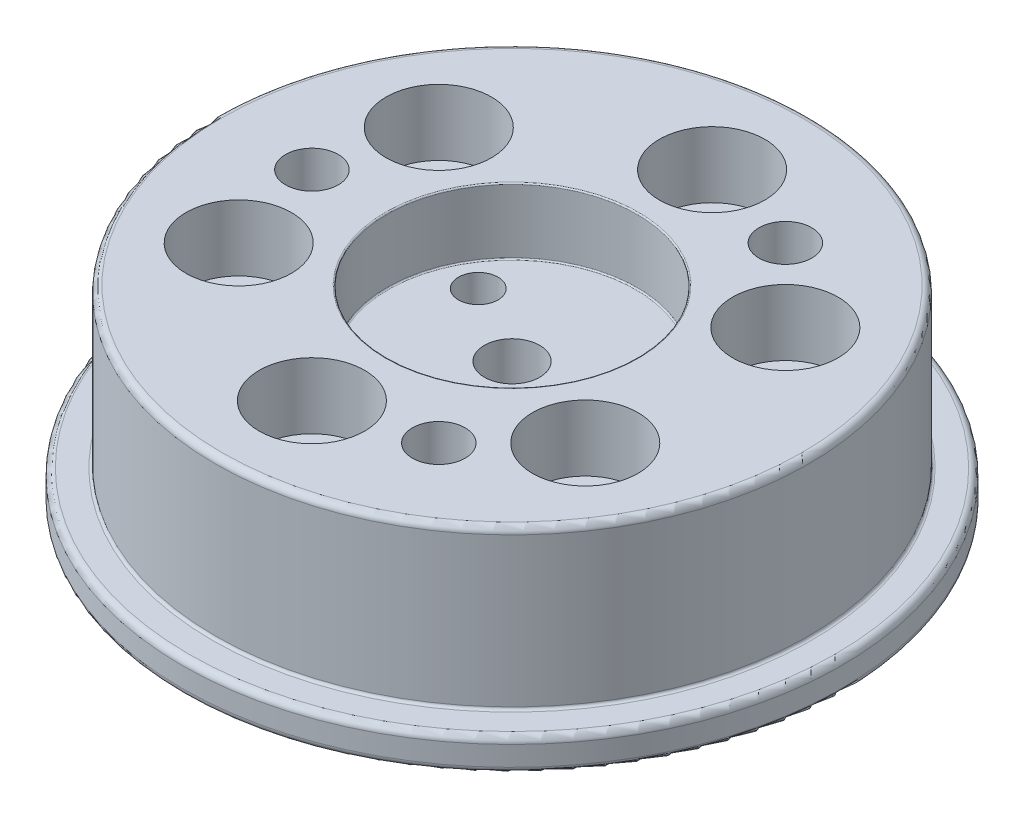
ISO-10303-21;
HEADER;
FILE_DESCRIPTION(('STEP AP214'),'2;1');
FILE_NAME('part.step','',(''),(''),'','','');
FILE_SCHEMA(('AUTOMOTIVE_DESIGN { 1 0 10303 214 1 1 1 1 }'));
ENDSEC;
DATA;
#1=APPLICATION_CONTEXT('core data for automotive mechanical design processes');
#2=APPLICATION_PROTOCOL_DEFINITION('international standard','automotive_design',2000,#1);
#3=PRODUCT_CONTEXT('',#1,'mechanical');
#4=PRODUCT('Part','Part','',(#3));
#5=PRODUCT_RELATED_PRODUCT_CATEGORY('part','',(#4));
#6=PRODUCT_DEFINITION_FORMATION('','',#4);
#7=PRODUCT_DEFINITION_CONTEXT('part definition',#1,'design');
#8=PRODUCT_DEFINITION('design','',#6,#7);
#9=PRODUCT_DEFINITION_SHAPE('','',#8);
#10=(LENGTH_UNIT() NAMED_UNIT(*) SI_UNIT(.MILLI.,.METRE.));
#11=(NAMED_UNIT(*) PLANE_ANGLE_UNIT() SI_UNIT($,.RADIAN.));
#12=(NAMED_UNIT(*) SI_UNIT($,.STERADIAN.) SOLID_ANGLE_UNIT());
#13=UNCERTAINTY_MEASURE_WITH_UNIT(LENGTH_MEASURE(1.E-05),#10,'distance_accuracy_value','');
#14=(GEOMETRIC_REPRESENTATION_CONTEXT(3) GLOBAL_UNCERTAINTY_ASSIGNED_CONTEXT((#13)) GLOBAL_UNIT_ASSIGNED_CONTEXT((#10,
#11,#12)) REPRESENTATION_CONTEXT('',''));
#15=CARTESIAN_POINT('',(0.,0.,0.));
#16=DIRECTION('',(0.,0.,1.));
#17=DIRECTION('',(1.,0.,0.));
#18=AXIS2_PLACEMENT_3D('',#15,#16,#17);
#19=CARTESIAN_POINT('',(0.,2.5,0.));
#20=DIRECTION('',(0.,-1.,0.));
#21=DIRECTION('',(0.,0.,-1.));
#22=AXIS2_PLACEMENT_3D('',#19,#20,#21);
#23=CYLINDRICAL_SURFACE('',#22,10.1);
#24=CARTESIAN_POINT('',(0.,0.5,0.));
#25=DIRECTION('',(0.,1.,0.));
#26=DIRECTION('',(0.,0.,1.));
#27=AXIS2_PLACEMENT_3D('',#24,#25,#26);
#28=CIRCLE('',#27,10.1);
#29=CARTESIAN_POINT('',(0.,0.5,10.1));
#30=VERTEX_POINT('',#29);
#31=EDGE_CURVE('E164',#30,#30,#28,.T.);
#32=ORIENTED_EDGE('',*,*,#31,.T.);
#33=EDGE_LOOP('',(#32));
#34=FACE_BOUND('',#33,.T.);
#35=CARTESIAN_POINT('',(0.,2.5,0.));
#36=DIRECTION('',(0.,1.,0.));
#37=DIRECTION('',(0.,0.,1.));
#38=AXIS2_PLACEMENT_3D('',#35,#36,#37);
#39=CIRCLE('',#38,10.1);
#40=CARTESIAN_POINT('',(0.,2.5,10.1));
#41=VERTEX_POINT('',#40);
#42=EDGE_CURVE('E161',#41,#41,#39,.T.);
#43=ORIENTED_EDGE('',*,*,#42,.F.);
#44=EDGE_LOOP('',(#43));
#45=FACE_BOUND('',#44,.T.);
#46=ADVANCED_FACE('F36',(#34,#45),#23,.T.);
#47=CARTESIAN_POINT('',(0.,0.,0.));
#48=DIRECTION('',(0.,1.,0.));
#49=DIRECTION('',(0.,0.,1.));
#50=AXIS2_PLACEMENT_3D('',#47,#48,#49);
#51=PLANE('',#50);
#52=CARTESIAN_POINT('',(0.,0.,0.));
#53=DIRECTION('',(0.,1.,0.));
#54=DIRECTION('',(0.,0.,1.));
#55=AXIS2_PLACEMENT_3D('',#52,#53,#54);
#56=CIRCLE('',#55,2.1);
#57=CARTESIAN_POINT('',(0.,0.,2.1));
#58=VERTEX_POINT('',#57);
#59=EDGE_CURVE('E71',#58,#58,#56,.T.);
#60=ORIENTED_EDGE('',*,*,#59,.T.);
#61=EDGE_LOOP('',(#60));
#62=FACE_BOUND('',#61,.T.);
#63=CARTESIAN_POINT('',(0.,0.,0.));
#64=DIRECTION('',(0.,1.,0.));
#65=DIRECTION('',(0.,0.,1.));
#66=AXIS2_PLACEMENT_3D('',#63,#64,#65);
#67=CIRCLE('',#66,9.6);
#68=CARTESIAN_POINT('',(0.,0.,9.6));
#69=VERTEX_POINT('',#68);
#70=EDGE_CURVE('E179',#69,#69,#67,.F.);
#71=ORIENTED_EDGE('',*,*,#70,.T.);
#72=EDGE_LOOP('',(#71));
#73=FACE_BOUND('',#72,.T.);
#74=ADVANCED_FACE('F244',(#62,#73),#51,.F.);
#75=CARTESIAN_POINT('',(0.,5.,0.));
#76=DIRECTION('',(0.,-1.,0.));
#77=DIRECTION('',(0.,0.,-1.));
#78=AXIS2_PLACEMENT_3D('',#75,#76,#77);
#79=CYLINDRICAL_SURFACE('',#78,25.);
#80=CARTESIAN_POINT('',(0.,3.,0.));
#81=DIRECTION('',(0.,1.,0.));
#82=DIRECTION('',(0.,0.,1.));
#83=AXIS2_PLACEMENT_3D('',#80,#81,#82);
#84=CIRCLE('',#83,25.);
#85=CARTESIAN_POINT('',(0.,3.,25.));
#86=VERTEX_POINT('',#85);
#87=EDGE_CURVE('E185',#86,#86,#84,.T.);
#88=ORIENTED_EDGE('',*,*,#87,.T.);
#89=EDGE_LOOP('',(#88));
#90=FACE_BOUND('',#89,.T.);
#91=CARTESIAN_POINT('',(0.,4.5,0.));
#92=DIRECTION('',(0.,1.,0.));
#93=DIRECTION('',(0.,0.,1.));
#94=AXIS2_PLACEMENT_3D('',#91,#92,#93);
#95=CIRCLE('',#94,25.);
#96=CARTESIAN_POINT('',(0.,4.5,25.));
#97=VERTEX_POINT('',#96);
#98=EDGE_CURVE('E182',#97,#97,#95,.F.);
#99=ORIENTED_EDGE('',*,*,#98,.T.);
#100=EDGE_LOOP('',(#99));
#101=FACE_BOUND('',#100,.T.);
#102=ADVANCED_FACE('F250',(#90,#101),#79,.T.);
#103=CARTESIAN_POINT('',(0.,5.,0.));
#104=DIRECTION('',(0.,1.,0.));
#105=DIRECTION('',(0.,0.,1.));
#106=AXIS2_PLACEMENT_3D('',#103,#104,#105);
#107=PLANE('',#106);
#108=CARTESIAN_POINT('',(0.,5.,0.));
#109=DIRECTION('',(0.,1.,0.));
#110=DIRECTION('',(0.,0.,1.));
#111=AXIS2_PLACEMENT_3D('',#108,#109,#110);
#112=CIRCLE('',#111,22.7);
#113=CARTESIAN_POINT('',(0.,5.,22.7));
#114=VERTEX_POINT('',#113);
#115=EDGE_CURVE('E203',#114,#114,#112,.F.);
#116=ORIENTED_EDGE('',*,*,#115,.T.);
#117=EDGE_LOOP('',(#116));
#118=FACE_BOUND('',#117,.T.);
#119=CARTESIAN_POINT('',(0.,5.,0.));
#120=DIRECTION('',(0.,1.,0.));
#121=DIRECTION('',(0.,0.,1.));
#122=AXIS2_PLACEMENT_3D('',#119,#120,#121);
#123=CIRCLE('',#122,24.5);
#124=CARTESIAN_POINT('',(0.,5.,24.5));
#125=VERTEX_POINT('',#124);
#126=EDGE_CURVE('E191',#125,#125,#123,.T.);
#127=ORIENTED_EDGE('',*,*,#126,.T.);
#128=EDGE_LOOP('',(#127));
#129=FACE_BOUND('',#128,.T.);
#130=ADVANCED_FACE('F333',(#118,#129),#107,.T.);
#131=CARTESIAN_POINT('',(0.,2.5,0.));
#132=DIRECTION('',(0.,1.,0.));
#133=DIRECTION('',(0.,0.,1.));
#134=AXIS2_PLACEMENT_3D('',#131,#132,#133);
#135=PLANE('',#134);
#136=CARTESIAN_POINT('',(7.58999999999988,2.5,-13.1462656294478));
#137=DIRECTION('',(0.,1.,0.));
#138=DIRECTION('',(0.,0.,1.));
#139=AXIS2_PLACEMENT_3D('',#136,#137,#138);
#140=CIRCLE('',#139,2.);
#141=CARTESIAN_POINT('',(7.58999999999988,2.5,-11.1462656294478));
#142=VERTEX_POINT('',#141);
#143=EDGE_CURVE('E86',#142,#142,#140,.T.);
#144=ORIENTED_EDGE('',*,*,#143,.T.);
#145=EDGE_LOOP('',(#144));
#146=FACE_BOUND('',#145,.T.);
#147=CARTESIAN_POINT('',(7.59000000000006,2.5,13.1462656294477));
#148=DIRECTION('',(0.,1.,0.));
#149=DIRECTION('',(0.,0.,1.));
#150=AXIS2_PLACEMENT_3D('',#147,#148,#149);
#151=CIRCLE('',#150,2.);
#152=CARTESIAN_POINT('',(7.59000000000006,2.5,15.1462656294477));
#153=VERTEX_POINT('',#152);
#154=EDGE_CURVE('E92',#153,#153,#151,.T.);
#155=ORIENTED_EDGE('',*,*,#154,.T.);
#156=EDGE_LOOP('',(#155));
#157=FACE_BOUND('',#156,.T.);
#158=CARTESIAN_POINT('',(-15.18,2.5,0.));
#159=DIRECTION('',(0.,1.,0.));
#160=DIRECTION('',(0.,0.,1.));
#161=AXIS2_PLACEMENT_3D('',#158,#159,#160);
#162=CIRCLE('',#161,2.);
#163=CARTESIAN_POINT('',(-15.18,2.5,2.));
#164=VERTEX_POINT('',#163);
#165=EDGE_CURVE('E98',#164,#164,#162,.T.);
#166=ORIENTED_EDGE('',*,*,#165,.T.);
#167=EDGE_LOOP('',(#166));
#168=FACE_BOUND('',#167,.T.);
#169=CARTESIAN_POINT('',(0.,2.5,0.));
#170=DIRECTION('',(0.,1.,0.));
#171=DIRECTION('',(0.,0.,1.));
#172=AXIS2_PLACEMENT_3D('',#169,#170,#171);
#173=CIRCLE('',#172,24.5);
#174=CARTESIAN_POINT('',(0.,2.5,24.5));
#175=VERTEX_POINT('',#174);
#176=EDGE_CURVE('E188',#175,#175,#173,.F.);
#177=ORIENTED_EDGE('',*,*,#176,.T.);
#178=EDGE_LOOP('',(#177));
#179=FACE_BOUND('',#178,.T.);
#180=CARTESIAN_POINT('',(13.1462656294477,2.5,-7.59000000000015));
#181=DIRECTION('',(0.,1.,0.));
#182=DIRECTION('',(0.,0.,1.));
#183=AXIS2_PLACEMENT_3D('',#180,#181,#182);
#184=CIRCLE('',#183,2.25);
#185=CARTESIAN_POINT('',(13.1462656294477,2.5,-5.34000000000016));
#186=VERTEX_POINT('',#185);
#187=EDGE_CURVE('E110',#186,#186,#184,.T.);
#188=ORIENTED_EDGE('',*,*,#187,.T.);
#189=EDGE_LOOP('',(#188));
#190=FACE_BOUND('',#189,.T.);
#191=CARTESIAN_POINT('',(13.1462656294478,2.5,7.58999999999988));
#192=DIRECTION('',(0.,1.,0.));
#193=DIRECTION('',(0.,0.,1.));
#194=AXIS2_PLACEMENT_3D('',#191,#192,#193);
#195=CIRCLE('',#194,2.25);
#196=CARTESIAN_POINT('',(13.1462656294478,2.5,9.83999999999988));
#197=VERTEX_POINT('',#196);
#198=EDGE_CURVE('E120',#197,#197,#195,.T.);
#199=ORIENTED_EDGE('',*,*,#198,.T.);
#200=EDGE_LOOP('',(#199));
#201=FACE_BOUND('',#200,.T.);
#202=CARTESIAN_POINT('',(0.,2.5,15.18));
#203=DIRECTION('',(0.,1.,0.));
#204=DIRECTION('',(0.,0.,1.));
#205=AXIS2_PLACEMENT_3D('',#202,#203,#204);
#206=CIRCLE('',#205,2.25);
#207=CARTESIAN_POINT('',(0.,2.5,17.43));
#208=VERTEX_POINT('',#207);
#209=EDGE_CURVE('E130',#208,#208,#206,.T.);
#210=ORIENTED_EDGE('',*,*,#209,.T.);
#211=EDGE_LOOP('',(#210));
#212=FACE_BOUND('',#211,.T.);
#213=CARTESIAN_POINT('',(-13.1462656294477,2.5,7.59000000000006));
#214=DIRECTION('',(0.,1.,0.));
#215=DIRECTION('',(0.,0.,1.));
#216=AXIS2_PLACEMENT_3D('',#213,#214,#215);
#217=CIRCLE('',#216,2.25);
#218=CARTESIAN_POINT('',(-13.1462656294477,2.5,9.84000000000006));
#219=VERTEX_POINT('',#218);
#220=EDGE_CURVE('E140',#219,#219,#217,.T.);
#221=ORIENTED_EDGE('',*,*,#220,.T.);
#222=EDGE_LOOP('',(#221));
#223=FACE_BOUND('',#222,.T.);
#224=CARTESIAN_POINT('',(-13.1462656294478,2.5,-7.58999999999997));
#225=DIRECTION('',(0.,1.,0.));
#226=DIRECTION('',(0.,0.,1.));
#227=AXIS2_PLACEMENT_3D('',#224,#225,#226);
#228=CIRCLE('',#227,2.25);
#229=CARTESIAN_POINT('',(-13.1462656294478,2.5,-5.33999999999997));
#230=VERTEX_POINT('',#229);
#231=EDGE_CURVE('E150',#230,#230,#228,.T.);
#232=ORIENTED_EDGE('',*,*,#231,.T.);
#233=EDGE_LOOP('',(#232));
#234=FACE_BOUND('',#233,.T.);
#235=CARTESIAN_POINT('',(0.,2.5,-15.18));
#236=DIRECTION('',(0.,1.,0.));
#237=DIRECTION('',(0.,0.,1.));
#238=AXIS2_PLACEMENT_3D('',#235,#236,#237);
#239=CIRCLE('',#238,2.25);
#240=CARTESIAN_POINT('',(0.,2.5,-12.93));
#241=VERTEX_POINT('',#240);
#242=EDGE_CURVE('E160',#241,#241,#239,.T.);
#243=ORIENTED_EDGE('',*,*,#242,.T.);
#244=EDGE_LOOP('',(#243));
#245=FACE_BOUND('',#244,.T.);
#246=ORIENTED_EDGE('',*,*,#42,.T.);
#247=EDGE_LOOP('',(#246));
#248=FACE_BOUND('',#247,.T.);
#249=ADVANCED_FACE('F290',(#146,#157,#168,#179,#190,#201,#212,#223,#234,#245,#248),#135,.F.);
#250=CARTESIAN_POINT('',(0.,17.,0.));
#251=DIRECTION('',(0.,-1.,0.));
#252=DIRECTION('',(0.,0.,-1.));
#253=AXIS2_PLACEMENT_3D('',#250,#251,#252);
#254=CYLINDRICAL_SURFACE('',#253,22.5);
#255=CARTESIAN_POINT('',(0.,5.2,0.));
#256=DIRECTION('',(0.,1.,0.));
#257=DIRECTION('',(0.,0.,1.));
#258=AXIS2_PLACEMENT_3D('',#255,#256,#257);
#259=CIRCLE('',#258,22.5);
#260=CARTESIAN_POINT('',(0.,5.2,22.5));
#261=VERTEX_POINT('',#260);
#262=EDGE_CURVE('E200',#261,#261,#259,.T.);
#263=ORIENTED_EDGE('',*,*,#262,.T.);
#264=EDGE_LOOP('',(#263));
#265=FACE_BOUND('',#264,.T.);
#266=CARTESIAN_POINT('',(0.,16.5,0.));
#267=DIRECTION('',(0.,1.,0.));
#268=DIRECTION('',(0.,0.,1.));
#269=AXIS2_PLACEMENT_3D('',#266,#267,#268);
#270=CIRCLE('',#269,22.5);
#271=CARTESIAN_POINT('',(0.,16.5,22.5));
#272=VERTEX_POINT('',#271);
#273=EDGE_CURVE('E197',#272,#272,#270,.F.);
#274=ORIENTED_EDGE('',*,*,#273,.T.);
#275=EDGE_LOOP('',(#274));
#276=FACE_BOUND('',#275,.T.);
#277=ADVANCED_FACE('F287',(#265,#276),#254,.T.);
#278=CARTESIAN_POINT('',(0.,17.,0.));
#279=DIRECTION('',(0.,1.,0.));
#280=DIRECTION('',(0.,0.,1.));
#281=AXIS2_PLACEMENT_3D('',#278,#279,#280);
#282=PLANE('',#281);
#283=CARTESIAN_POINT('',(0.,17.,0.));
#284=DIRECTION('',(0.,1.,0.));
#285=DIRECTION('',(0.,0.,1.));
#286=AXIS2_PLACEMENT_3D('',#283,#284,#285);
#287=CIRCLE('',#286,9.6);
#288=CARTESIAN_POINT('',(0.,17.,9.6));
#289=VERTEX_POINT('',#288);
#290=EDGE_CURVE('E44',#289,#289,#287,.F.);
#291=ORIENTED_EDGE('',*,*,#290,.T.);
#292=EDGE_LOOP('',(#291));
#293=FACE_BOUND('',#292,.T.);
#294=CARTESIAN_POINT('',(7.58999999999988,17.,-13.1462656294478));
#295=DIRECTION('',(0.,1.,0.));
#296=DIRECTION('',(0.,0.,1.));
#297=AXIS2_PLACEMENT_3D('',#294,#295,#296);
#298=CIRCLE('',#297,2.);
#299=CARTESIAN_POINT('',(7.58999999999988,17.,-11.1462656294478));
#300=VERTEX_POINT('',#299);
#301=EDGE_CURVE('E83',#300,#300,#298,.T.);
#302=ORIENTED_EDGE('',*,*,#301,.F.);
#303=EDGE_LOOP('',(#302));
#304=FACE_BOUND('',#303,.T.);
#305=CARTESIAN_POINT('',(7.59000000000006,17.,13.1462656294477));
#306=DIRECTION('',(0.,1.,0.));
#307=DIRECTION('',(0.,0.,1.));
#308=AXIS2_PLACEMENT_3D('',#305,#306,#307);
#309=CIRCLE('',#308,2.);
#310=CARTESIAN_POINT('',(7.59000000000006,17.,15.1462656294477));
#311=VERTEX_POINT('',#310);
#312=EDGE_CURVE('E89',#311,#311,#309,.T.);
#313=ORIENTED_EDGE('',*,*,#312,.F.);
#314=EDGE_LOOP('',(#313));
#315=FACE_BOUND('',#314,.T.);
#316=CARTESIAN_POINT('',(-15.18,17.,0.));
#317=DIRECTION('',(0.,1.,0.));
#318=DIRECTION('',(0.,0.,1.));
#319=AXIS2_PLACEMENT_3D('',#316,#317,#318);
#320=CIRCLE('',#319,2.);
#321=CARTESIAN_POINT('',(-15.18,17.,2.));
#322=VERTEX_POINT('',#321);
#323=EDGE_CURVE('E95',#322,#322,#320,.T.);
#324=ORIENTED_EDGE('',*,*,#323,.F.);
#325=EDGE_LOOP('',(#324));
#326=FACE_BOUND('',#325,.T.);
#327=CARTESIAN_POINT('',(0.,17.,0.));
#328=DIRECTION('',(0.,1.,0.));
#329=DIRECTION('',(0.,0.,1.));
#330=AXIS2_PLACEMENT_3D('',#327,#328,#329);
#331=CIRCLE('',#330,22.);
#332=CARTESIAN_POINT('',(0.,17.,22.));
#333=VERTEX_POINT('',#332);
#334=EDGE_CURVE('E194',#333,#333,#331,.T.);
#335=ORIENTED_EDGE('',*,*,#334,.T.);
#336=EDGE_LOOP('',(#335));
#337=FACE_BOUND('',#336,.T.);
#338=CARTESIAN_POINT('',(13.1462656294477,17.,-7.59000000000015));
#339=DIRECTION('',(0.,1.,0.));
#340=DIRECTION('',(0.,0.,1.));
#341=AXIS2_PLACEMENT_3D('',#338,#339,#340);
#342=CIRCLE('',#341,4.);
#343=CARTESIAN_POINT('',(13.1462656294477,17.,-3.59000000000016));
#344=VERTEX_POINT('',#343);
#345=EDGE_CURVE('E101',#344,#344,#342,.T.);
#346=ORIENTED_EDGE('',*,*,#345,.F.);
#347=EDGE_LOOP('',(#346));
#348=FACE_BOUND('',#347,.T.);
#349=CARTESIAN_POINT('',(13.1462656294478,17.,7.58999999999988));
#350=DIRECTION('',(0.,1.,0.));
#351=DIRECTION('',(0.,0.,1.));
#352=AXIS2_PLACEMENT_3D('',#349,#350,#351);
#353=CIRCLE('',#352,4.);
#354=CARTESIAN_POINT('',(13.1462656294478,17.,11.5899999999999));
#355=VERTEX_POINT('',#354);
#356=EDGE_CURVE('E111',#355,#355,#353,.T.);
#357=ORIENTED_EDGE('',*,*,#356,.F.);
#358=EDGE_LOOP('',(#357));
#359=FACE_BOUND('',#358,.T.);
#360=CARTESIAN_POINT('',(0.,17.,15.18));
#361=DIRECTION('',(0.,1.,0.));
#362=DIRECTION('',(0.,0.,1.));
#363=AXIS2_PLACEMENT_3D('',#360,#361,#362);
#364=CIRCLE('',#363,4.);
#365=CARTESIAN_POINT('',(0.,17.,19.18));
#366=VERTEX_POINT('',#365);
#367=EDGE_CURVE('E121',#366,#366,#364,.T.);
#368=ORIENTED_EDGE('',*,*,#367,.F.);
#369=EDGE_LOOP('',(#368));
#370=FACE_BOUND('',#369,.T.);
#371=CARTESIAN_POINT('',(-13.1462656294477,17.,7.59000000000006));
#372=DIRECTION('',(0.,1.,0.));
#373=DIRECTION('',(0.,0.,1.));
#374=AXIS2_PLACEMENT_3D('',#371,#372,#373);
#375=CIRCLE('',#374,4.);
#376=CARTESIAN_POINT('',(-13.1462656294477,17.,11.5900000000001));
#377=VERTEX_POINT('',#376);
#378=EDGE_CURVE('E131',#377,#377,#375,.T.);
#379=ORIENTED_EDGE('',*,*,#378,.F.);
#380=EDGE_LOOP('',(#379));
#381=FACE_BOUND('',#380,.T.);
#382=CARTESIAN_POINT('',(-13.1462656294478,17.,-7.58999999999997));
#383=DIRECTION('',(0.,1.,0.));
#384=DIRECTION('',(0.,0.,1.));
#385=AXIS2_PLACEMENT_3D('',#382,#383,#384);
#386=CIRCLE('',#385,4.);
#387=CARTESIAN_POINT('',(-13.1462656294478,17.,-3.58999999999997));
#388=VERTEX_POINT('',#387);
#389=EDGE_CURVE('E141',#388,#388,#386,.T.);
#390=ORIENTED_EDGE('',*,*,#389,.F.);
#391=EDGE_LOOP('',(#390));
#392=FACE_BOUND('',#391,.T.);
#393=CARTESIAN_POINT('',(0.,17.,-15.18));
#394=DIRECTION('',(0.,1.,0.));
#395=DIRECTION('',(0.,0.,1.));
#396=AXIS2_PLACEMENT_3D('',#393,#394,#395);
#397=CIRCLE('',#396,4.);
#398=CARTESIAN_POINT('',(0.,17.,-11.18));
#399=VERTEX_POINT('',#398);
#400=EDGE_CURVE('E151',#399,#399,#397,.T.);
#401=ORIENTED_EDGE('',*,*,#400,.F.);
#402=EDGE_LOOP('',(#401));
#403=FACE_BOUND('',#402,.T.);
#404=ADVANCED_FACE('F214',(#293,#304,#315,#326,#337,#348,#359,#370,#381,#392,#403),#282,.T.);
#405=CARTESIAN_POINT('',(0.,17.,-15.18));
#406=DIRECTION('',(0.,1.,0.));
#407=DIRECTION('',(0.,0.,1.));
#408=AXIS2_PLACEMENT_3D('',#405,#406,#407);
#409=CYLINDRICAL_SURFACE('',#408,2.25);
#410=CARTESIAN_POINT('',(0.,12.,-15.18));
#411=DIRECTION('',(0.,1.,0.));
#412=DIRECTION('',(0.,0.,1.));
#413=AXIS2_PLACEMENT_3D('',#410,#411,#412);
#414=CIRCLE('',#413,2.25);
#415=CARTESIAN_POINT('',(0.,12.,-12.93));
#416=VERTEX_POINT('',#415);
#417=EDGE_CURVE('E157',#416,#416,#414,.T.);
#418=ORIENTED_EDGE('',*,*,#417,.T.);
#419=EDGE_LOOP('',(#418));
#420=FACE_BOUND('',#419,.T.);
#421=ORIENTED_EDGE('',*,*,#242,.F.);
#422=EDGE_LOOP('',(#421));
#423=FACE_BOUND('',#422,.T.);
#424=ADVANCED_FACE('F298',(#420,#423),#409,.F.);
#425=CARTESIAN_POINT('',(2.25,12.,-15.18));
#426=DIRECTION('',(0.,-1.,0.));
#427=DIRECTION('',(0.,0.,-1.));
#428=AXIS2_PLACEMENT_3D('',#425,#426,#427);
#429=PLANE('',#428);
#430=ORIENTED_EDGE('',*,*,#417,.F.);
#431=EDGE_LOOP('',(#430));
#432=FACE_BOUND('',#431,.T.);
#433=CARTESIAN_POINT('',(0.,12.,-15.18));
#434=DIRECTION('',(0.,1.,0.));
#435=DIRECTION('',(0.,0.,1.));
#436=AXIS2_PLACEMENT_3D('',#433,#434,#435);
#437=CIRCLE('',#436,4.);
#438=CARTESIAN_POINT('',(0.,12.,-11.18));
#439=VERTEX_POINT('',#438);
#440=EDGE_CURVE('E154',#439,#439,#437,.T.);
#441=ORIENTED_EDGE('',*,*,#440,.T.);
#442=EDGE_LOOP('',(#441));
#443=FACE_BOUND('',#442,.T.);
#444=ADVANCED_FACE('F315',(#432,#443),#429,.F.);
#445=CARTESIAN_POINT('',(0.,17.,-15.18));
#446=DIRECTION('',(0.,1.,0.));
#447=DIRECTION('',(0.,0.,1.));
#448=AXIS2_PLACEMENT_3D('',#445,#446,#447);
#449=CYLINDRICAL_SURFACE('',#448,4.);
#450=ORIENTED_EDGE('',*,*,#440,.F.);
#451=EDGE_LOOP('',(#450));
#452=FACE_BOUND('',#451,.T.);
#453=ORIENTED_EDGE('',*,*,#400,.T.);
#454=EDGE_LOOP('',(#453));
#455=FACE_BOUND('',#454,.T.);
#456=ADVANCED_FACE('F312',(#452,#455),#449,.F.);
#457=CARTESIAN_POINT('',(-13.1462656294478,17.,-7.58999999999997));
#458=DIRECTION('',(0.,1.,0.));
#459=DIRECTION('',(0.,0.,1.));
#460=AXIS2_PLACEMENT_3D('',#457,#458,#459);
#461=CYLINDRICAL_SURFACE('',#460,2.25);
#462=CARTESIAN_POINT('',(-13.1462656294478,12.,-7.58999999999997));
#463=DIRECTION('',(0.,1.,0.));
#464=DIRECTION('',(0.,0.,1.));
#465=AXIS2_PLACEMENT_3D('',#462,#463,#464);
#466=CIRCLE('',#465,2.25);
#467=CARTESIAN_POINT('',(-13.1462656294478,12.,-5.33999999999997));
#468=VERTEX_POINT('',#467);
#469=EDGE_CURVE('E147',#468,#468,#466,.T.);
#470=ORIENTED_EDGE('',*,*,#469,.T.);
#471=EDGE_LOOP('',(#470));
#472=FACE_BOUND('',#471,.T.);
#473=ORIENTED_EDGE('',*,*,#231,.F.);
#474=EDGE_LOOP('',(#473));
#475=FACE_BOUND('',#474,.T.);
#476=ADVANCED_FACE('F314',(#472,#475),#461,.F.);
#477=CARTESIAN_POINT('',(-10.8962656294478,12.,-7.58999999999997));
#478=DIRECTION('',(0.,-1.,0.));
#479=DIRECTION('',(0.,0.,-1.));
#480=AXIS2_PLACEMENT_3D('',#477,#478,#479);
#481=PLANE('',#480);
#482=ORIENTED_EDGE('',*,*,#469,.F.);
#483=EDGE_LOOP('',(#482));
#484=FACE_BOUND('',#483,.T.);
#485=CARTESIAN_POINT('',(-13.1462656294478,12.,-7.58999999999997));
#486=DIRECTION('',(0.,1.,0.));
#487=DIRECTION('',(0.,0.,1.));
#488=AXIS2_PLACEMENT_3D('',#485,#486,#487);
#489=CIRCLE('',#488,4.);
#490=CARTESIAN_POINT('',(-13.1462656294478,12.,-3.58999999999997));
#491=VERTEX_POINT('',#490);
#492=EDGE_CURVE('E144',#491,#491,#489,.T.);
#493=ORIENTED_EDGE('',*,*,#492,.T.);
#494=EDGE_LOOP('',(#493));
#495=FACE_BOUND('',#494,.T.);
#496=ADVANCED_FACE('F322',(#484,#495),#481,.F.);
#497=CARTESIAN_POINT('',(-13.1462656294478,17.,-7.58999999999997));
#498=DIRECTION('',(0.,1.,0.));
#499=DIRECTION('',(0.,0.,1.));
#500=AXIS2_PLACEMENT_3D('',#497,#498,#499);
#501=CYLINDRICAL_SURFACE('',#500,4.);
#502=ORIENTED_EDGE('',*,*,#492,.F.);
#503=EDGE_LOOP('',(#502));
#504=FACE_BOUND('',#503,.T.);
#505=ORIENTED_EDGE('',*,*,#389,.T.);
#506=EDGE_LOOP('',(#505));
#507=FACE_BOUND('',#506,.T.);
#508=ADVANCED_FACE('F401',(#504,#507),#501,.F.);
#509=CARTESIAN_POINT('',(-13.1462656294477,17.,7.59000000000006));
#510=DIRECTION('',(0.,1.,0.));
#511=DIRECTION('',(0.,0.,1.));
#512=AXIS2_PLACEMENT_3D('',#509,#510,#511);
#513=CYLINDRICAL_SURFACE('',#512,2.25);
#514=CARTESIAN_POINT('',(-13.1462656294477,12.,7.59000000000006));
#515=DIRECTION('',(0.,1.,0.));
#516=DIRECTION('',(0.,0.,1.));
#517=AXIS2_PLACEMENT_3D('',#514,#515,#516);
#518=CIRCLE('',#517,2.25);
#519=CARTESIAN_POINT('',(-13.1462656294477,12.,9.84000000000006));
#520=VERTEX_POINT('',#519);
#521=EDGE_CURVE('E137',#520,#520,#518,.T.);
#522=ORIENTED_EDGE('',*,*,#521,.T.);
#523=EDGE_LOOP('',(#522));
#524=FACE_BOUND('',#523,.T.);
#525=ORIENTED_EDGE('',*,*,#220,.F.);
#526=EDGE_LOOP('',(#525));
#527=FACE_BOUND('',#526,.T.);
#528=ADVANCED_FACE('F410',(#524,#527),#513,.F.);
#529=CARTESIAN_POINT('',(-10.8962656294477,12.,7.59000000000006));
#530=DIRECTION('',(0.,-1.,0.));
#531=DIRECTION('',(0.,0.,-1.));
#532=AXIS2_PLACEMENT_3D('',#529,#530,#531);
#533=PLANE('',#532);
#534=ORIENTED_EDGE('',*,*,#521,.F.);
#535=EDGE_LOOP('',(#534));
#536=FACE_BOUND('',#535,.T.);
#537=CARTESIAN_POINT('',(-13.1462656294477,12.,7.59000000000006));
#538=DIRECTION('',(0.,1.,0.));
#539=DIRECTION('',(0.,0.,1.));
#540=AXIS2_PLACEMENT_3D('',#537,#538,#539);
#541=CIRCLE('',#540,4.);
#542=CARTESIAN_POINT('',(-13.1462656294477,12.,11.5900000000001));
#543=VERTEX_POINT('',#542);
#544=EDGE_CURVE('E134',#543,#543,#541,.T.);
#545=ORIENTED_EDGE('',*,*,#544,.T.);
#546=EDGE_LOOP('',(#545));
#547=FACE_BOUND('',#546,.T.);
#548=ADVANCED_FACE('F420',(#536,#547),#533,.F.);
#549=CARTESIAN_POINT('',(-13.1462656294477,17.,7.59000000000006));
#550=DIRECTION('',(0.,1.,0.));
#551=DIRECTION('',(0.,0.,1.));
#552=AXIS2_PLACEMENT_3D('',#549,#550,#551);
#553=CYLINDRICAL_SURFACE('',#552,4.);
#554=ORIENTED_EDGE('',*,*,#544,.F.);
#555=EDGE_LOOP('',(#554));
#556=FACE_BOUND('',#555,.T.);
#557=ORIENTED_EDGE('',*,*,#378,.T.);
#558=EDGE_LOOP('',(#557));
#559=FACE_BOUND('',#558,.T.);
#560=ADVANCED_FACE('F430',(#556,#559),#553,.F.);
#561=CARTESIAN_POINT('',(0.,17.,15.18));
#562=DIRECTION('',(0.,1.,0.));
#563=DIRECTION('',(0.,0.,1.));
#564=AXIS2_PLACEMENT_3D('',#561,#562,#563);
#565=CYLINDRICAL_SURFACE('',#564,2.25);
#566=CARTESIAN_POINT('',(0.,12.,15.18));
#567=DIRECTION('',(0.,1.,0.));
#568=DIRECTION('',(0.,0.,1.));
#569=AXIS2_PLACEMENT_3D('',#566,#567,#568);
#570=CIRCLE('',#569,2.25);
#571=CARTESIAN_POINT('',(0.,12.,17.43));
#572=VERTEX_POINT('',#571);
#573=EDGE_CURVE('E127',#572,#572,#570,.T.);
#574=ORIENTED_EDGE('',*,*,#573,.T.);
#575=EDGE_LOOP('',(#574));
#576=FACE_BOUND('',#575,.T.);
#577=ORIENTED_EDGE('',*,*,#209,.F.);
#578=EDGE_LOOP('',(#577));
#579=FACE_BOUND('',#578,.T.);
#580=ADVANCED_FACE('F440',(#576,#579),#565,.F.);
#581=CARTESIAN_POINT('',(2.25,12.,15.18));
#582=DIRECTION('',(0.,-1.,0.));
#583=DIRECTION('',(0.,0.,-1.));
#584=AXIS2_PLACEMENT_3D('',#581,#582,#583);
#585=PLANE('',#584);
#586=ORIENTED_EDGE('',*,*,#573,.F.);
#587=EDGE_LOOP('',(#586));
#588=FACE_BOUND('',#587,.T.);
#589=CARTESIAN_POINT('',(0.,12.,15.18));
#590=DIRECTION('',(0.,1.,0.));
#591=DIRECTION('',(0.,0.,1.));
#592=AXIS2_PLACEMENT_3D('',#589,#590,#591);
#593=CIRCLE('',#592,4.);
#594=CARTESIAN_POINT('',(0.,12.,19.18));
#595=VERTEX_POINT('',#594);
#596=EDGE_CURVE('E124',#595,#595,#593,.T.);
#597=ORIENTED_EDGE('',*,*,#596,.T.);
#598=EDGE_LOOP('',(#597));
#599=FACE_BOUND('',#598,.T.);
#600=ADVANCED_FACE('F450',(#588,#599),#585,.F.);
#601=CARTESIAN_POINT('',(0.,17.,15.18));
#602=DIRECTION('',(0.,1.,0.));
#603=DIRECTION('',(0.,0.,1.));
#604=AXIS2_PLACEMENT_3D('',#601,#602,#603);
#605=CYLINDRICAL_SURFACE('',#604,4.);
#606=ORIENTED_EDGE('',*,*,#596,.F.);
#607=EDGE_LOOP('',(#606));
#608=FACE_BOUND('',#607,.T.);
#609=ORIENTED_EDGE('',*,*,#367,.T.);
#610=EDGE_LOOP('',(#609));
#611=FACE_BOUND('',#610,.T.);
#612=ADVANCED_FACE('F460',(#608,#611),#605,.F.);
#613=CARTESIAN_POINT('',(13.1462656294478,17.,7.58999999999988));
#614=DIRECTION('',(0.,1.,0.));
#615=DIRECTION('',(0.,0.,1.));
#616=AXIS2_PLACEMENT_3D('',#613,#614,#615);
#617=CYLINDRICAL_SURFACE('',#616,2.25);
#618=CARTESIAN_POINT('',(13.1462656294478,12.,7.58999999999988));
#619=DIRECTION('',(0.,1.,0.));
#620=DIRECTION('',(0.,0.,1.));
#621=AXIS2_PLACEMENT_3D('',#618,#619,#620);
#622=CIRCLE('',#621,2.25);
#623=CARTESIAN_POINT('',(13.1462656294478,12.,9.83999999999988));
#624=VERTEX_POINT('',#623);
#625=EDGE_CURVE('E117',#624,#624,#622,.T.);
#626=ORIENTED_EDGE('',*,*,#625,.T.);
#627=EDGE_LOOP('',(#626));
#628=FACE_BOUND('',#627,.T.);
#629=ORIENTED_EDGE('',*,*,#198,.F.);
#630=EDGE_LOOP('',(#629));
#631=FACE_BOUND('',#630,.T.);
#632=ADVANCED_FACE('F470',(#628,#631),#617,.F.);
#633=CARTESIAN_POINT('',(15.3962656294478,12.,7.58999999999988));
#634=DIRECTION('',(0.,-1.,0.));
#635=DIRECTION('',(0.,0.,-1.));
#636=AXIS2_PLACEMENT_3D('',#633,#634,#635);
#637=PLANE('',#636);
#638=ORIENTED_EDGE('',*,*,#625,.F.);
#639=EDGE_LOOP('',(#638));
#640=FACE_BOUND('',#639,.T.);
#641=CARTESIAN_POINT('',(13.1462656294478,12.,7.58999999999988));
#642=DIRECTION('',(0.,1.,0.));
#643=DIRECTION('',(0.,0.,1.));
#644=AXIS2_PLACEMENT_3D('',#641,#642,#643);
#645=CIRCLE('',#644,4.);
#646=CARTESIAN_POINT('',(13.1462656294478,12.,11.5899999999999));
#647=VERTEX_POINT('',#646);
#648=EDGE_CURVE('E114',#647,#647,#645,.T.);
#649=ORIENTED_EDGE('',*,*,#648,.T.);
#650=EDGE_LOOP('',(#649));
#651=FACE_BOUND('',#650,.T.);
#652=ADVANCED_FACE('F480',(#640,#651),#637,.F.);
#653=CARTESIAN_POINT('',(13.1462656294478,17.,7.58999999999988));
#654=DIRECTION('',(0.,1.,0.));
#655=DIRECTION('',(0.,0.,1.));
#656=AXIS2_PLACEMENT_3D('',#653,#654,#655);
#657=CYLINDRICAL_SURFACE('',#656,4.);
#658=ORIENTED_EDGE('',*,*,#648,.F.);
#659=EDGE_LOOP('',(#658));
#660=FACE_BOUND('',#659,.T.);
#661=ORIENTED_EDGE('',*,*,#356,.T.);
#662=EDGE_LOOP('',(#661));
#663=FACE_BOUND('',#662,.T.);
#664=ADVANCED_FACE('F490',(#660,#663),#657,.F.);
#665=CARTESIAN_POINT('',(13.1462656294477,17.,-7.59000000000015));
#666=DIRECTION('',(0.,1.,0.));
#667=DIRECTION('',(0.,0.,1.));
#668=AXIS2_PLACEMENT_3D('',#665,#666,#667);
#669=CYLINDRICAL_SURFACE('',#668,2.25);
#670=CARTESIAN_POINT('',(13.1462656294477,12.,-7.59000000000015));
#671=DIRECTION('',(0.,1.,0.));
#672=DIRECTION('',(0.,0.,1.));
#673=AXIS2_PLACEMENT_3D('',#670,#671,#672);
#674=CIRCLE('',#673,2.25);
#675=CARTESIAN_POINT('',(13.1462656294477,12.,-5.34000000000015));
#676=VERTEX_POINT('',#675);
#677=EDGE_CURVE('E107',#676,#676,#674,.T.);
#678=ORIENTED_EDGE('',*,*,#677,.T.);
#679=EDGE_LOOP('',(#678));
#680=FACE_BOUND('',#679,.T.);
#681=ORIENTED_EDGE('',*,*,#187,.F.);
#682=EDGE_LOOP('',(#681));
#683=FACE_BOUND('',#682,.T.);
#684=ADVANCED_FACE('F500',(#680,#683),#669,.F.);
#685=CARTESIAN_POINT('',(15.3962656294477,12.,-7.59000000000015));
#686=DIRECTION('',(0.,-1.,0.));
#687=DIRECTION('',(0.,0.,-1.));
#688=AXIS2_PLACEMENT_3D('',#685,#686,#687);
#689=PLANE('',#688);
#690=ORIENTED_EDGE('',*,*,#677,.F.);
#691=EDGE_LOOP('',(#690));
#692=FACE_BOUND('',#691,.T.);
#693=CARTESIAN_POINT('',(13.1462656294477,12.,-7.59000000000015));
#694=DIRECTION('',(0.,1.,0.));
#695=DIRECTION('',(0.,0.,1.));
#696=AXIS2_PLACEMENT_3D('',#693,#694,#695);
#697=CIRCLE('',#696,4.);
#698=CARTESIAN_POINT('',(13.1462656294477,12.,-3.59000000000016));
#699=VERTEX_POINT('',#698);
#700=EDGE_CURVE('E104',#699,#699,#697,.T.);
#701=ORIENTED_EDGE('',*,*,#700,.T.);
#702=EDGE_LOOP('',(#701));
#703=FACE_BOUND('',#702,.T.);
#704=ADVANCED_FACE('F510',(#692,#703),#689,.F.);
#705=CARTESIAN_POINT('',(13.1462656294477,17.,-7.59000000000015));
#706=DIRECTION('',(0.,1.,0.));
#707=DIRECTION('',(0.,0.,1.));
#708=AXIS2_PLACEMENT_3D('',#705,#706,#707);
#709=CYLINDRICAL_SURFACE('',#708,4.);
#710=ORIENTED_EDGE('',*,*,#700,.F.);
#711=EDGE_LOOP('',(#710));
#712=FACE_BOUND('',#711,.T.);
#713=ORIENTED_EDGE('',*,*,#345,.T.);
#714=EDGE_LOOP('',(#713));
#715=FACE_BOUND('',#714,.T.);
#716=ADVANCED_FACE('F260',(#712,#715),#709,.F.);
#717=CARTESIAN_POINT('',(0.,0.5,0.));
#718=DIRECTION('',(0.,1.,0.));
#719=DIRECTION('',(0.,0.,1.));
#720=AXIS2_PLACEMENT_3D('',#717,#718,#719);
#721=TOROIDAL_SURFACE('',#720,9.6,0.5);
#722=ORIENTED_EDGE('',*,*,#70,.F.);
#723=EDGE_LOOP('',(#722));
#724=FACE_BOUND('',#723,.T.);
#725=ORIENTED_EDGE('',*,*,#31,.F.);
#726=EDGE_LOOP('',(#725));
#727=FACE_BOUND('',#726,.T.);
#728=ADVANCED_FACE('F256',(#724,#727),#721,.T.);
#729=CARTESIAN_POINT('',(0.,3.,0.));
#730=DIRECTION('',(0.,1.,0.));
#731=DIRECTION('',(0.,0.,1.));
#732=AXIS2_PLACEMENT_3D('',#729,#730,#731);
#733=TOROIDAL_SURFACE('',#732,24.5,0.5);
#734=ORIENTED_EDGE('',*,*,#176,.F.);
#735=EDGE_LOOP('',(#734));
#736=FACE_BOUND('',#735,.T.);
#737=ORIENTED_EDGE('',*,*,#87,.F.);
#738=EDGE_LOOP('',(#737));
#739=FACE_BOUND('',#738,.T.);
#740=ADVANCED_FACE('F259',(#736,#739),#733,.T.);
#741=CARTESIAN_POINT('',(0.,4.5,0.));
#742=DIRECTION('',(0.,1.,0.));
#743=DIRECTION('',(0.,0.,1.));
#744=AXIS2_PLACEMENT_3D('',#741,#742,#743);
#745=TOROIDAL_SURFACE('',#744,24.5,0.5);
#746=ORIENTED_EDGE('',*,*,#98,.F.);
#747=EDGE_LOOP('',(#746));
#748=FACE_BOUND('',#747,.T.);
#749=ORIENTED_EDGE('',*,*,#126,.F.);
#750=EDGE_LOOP('',(#749));
#751=FACE_BOUND('',#750,.T.);
#752=ADVANCED_FACE('F264',(#748,#751),#745,.T.);
#753=CARTESIAN_POINT('',(0.,16.5,0.));
#754=DIRECTION('',(0.,1.,0.));
#755=DIRECTION('',(0.,0.,1.));
#756=AXIS2_PLACEMENT_3D('',#753,#754,#755);
#757=TOROIDAL_SURFACE('',#756,22.,0.5);
#758=ORIENTED_EDGE('',*,*,#273,.F.);
#759=EDGE_LOOP('',(#758));
#760=FACE_BOUND('',#759,.T.);
#761=ORIENTED_EDGE('',*,*,#334,.F.);
#762=EDGE_LOOP('',(#761));
#763=FACE_BOUND('',#762,.T.);
#764=ADVANCED_FACE('F268',(#760,#763),#757,.T.);
#765=CARTESIAN_POINT('',(0.,5.2,0.));
#766=DIRECTION('',(0.,1.,0.));
#767=DIRECTION('',(0.,0.,1.));
#768=AXIS2_PLACEMENT_3D('',#765,#766,#767);
#769=TOROIDAL_SURFACE('',#768,22.7,0.2);
#770=ORIENTED_EDGE('',*,*,#115,.F.);
#771=EDGE_LOOP('',(#770));
#772=FACE_BOUND('',#771,.T.);
#773=ORIENTED_EDGE('',*,*,#262,.F.);
#774=EDGE_LOOP('',(#773));
#775=FACE_BOUND('',#774,.T.);
#776=ADVANCED_FACE('F272',(#772,#775),#769,.F.);
#777=CARTESIAN_POINT('',(-15.18,17.,0.));
#778=DIRECTION('',(0.,1.,0.));
#779=DIRECTION('',(0.,0.,1.));
#780=AXIS2_PLACEMENT_3D('',#777,#778,#779);
#781=CYLINDRICAL_SURFACE('',#780,2.);
#782=ORIENTED_EDGE('',*,*,#323,.T.);
#783=EDGE_LOOP('',(#782));
#784=FACE_BOUND('',#783,.T.);
#785=ORIENTED_EDGE('',*,*,#165,.F.);
#786=EDGE_LOOP('',(#785));
#787=FACE_BOUND('',#786,.T.);
#788=ADVANCED_FACE('F275',(#784,#787),#781,.F.);
#789=CARTESIAN_POINT('',(7.59000000000006,17.,13.1462656294477));
#790=DIRECTION('',(0.,1.,0.));
#791=DIRECTION('',(0.,0.,1.));
#792=AXIS2_PLACEMENT_3D('',#789,#790,#791);
#793=CYLINDRICAL_SURFACE('',#792,2.);
#794=ORIENTED_EDGE('',*,*,#312,.T.);
#795=EDGE_LOOP('',(#794));
#796=FACE_BOUND('',#795,.T.);
#797=ORIENTED_EDGE('',*,*,#154,.F.);
#798=EDGE_LOOP('',(#797));
#799=FACE_BOUND('',#798,.T.);
#800=ADVANCED_FACE('F280',(#796,#799),#793,.F.);
#801=CARTESIAN_POINT('',(7.58999999999988,17.,-13.1462656294478));
#802=DIRECTION('',(0.,1.,0.));
#803=DIRECTION('',(0.,0.,1.));
#804=AXIS2_PLACEMENT_3D('',#801,#802,#803);
#805=CYLINDRICAL_SURFACE('',#804,2.);
#806=ORIENTED_EDGE('',*,*,#301,.T.);
#807=EDGE_LOOP('',(#806));
#808=FACE_BOUND('',#807,.T.);
#809=ORIENTED_EDGE('',*,*,#143,.F.);
#810=EDGE_LOOP('',(#809));
#811=FACE_BOUND('',#810,.T.);
#812=ADVANCED_FACE('F226',(#808,#811),#805,.F.);
#813=CARTESIAN_POINT('',(0.,12.,0.));
#814=DIRECTION('',(0.,1.,0.));
#815=DIRECTION('',(0.,0.,1.));
#816=AXIS2_PLACEMENT_3D('',#813,#814,#815);
#817=CYLINDRICAL_SURFACE('',#816,9.5);
#818=CARTESIAN_POINT('',(0.,16.9,0.));
#819=DIRECTION('',(0.,1.,0.));
#820=DIRECTION('',(0.,0.,1.));
#821=AXIS2_PLACEMENT_3D('',#818,#819,#820);
#822=CIRCLE('',#821,9.5);
#823=CARTESIAN_POINT('',(0.,16.9,9.5));
#824=VERTEX_POINT('',#823);
#825=EDGE_CURVE('E209',#824,#824,#822,.T.);
#826=ORIENTED_EDGE('',*,*,#825,.T.);
#827=EDGE_LOOP('',(#826));
#828=FACE_BOUND('',#827,.T.);
#829=CARTESIAN_POINT('',(0.,12.1,0.));
#830=DIRECTION('',(0.,1.,0.));
#831=DIRECTION('',(0.,0.,1.));
#832=AXIS2_PLACEMENT_3D('',#829,#830,#831);
#833=CIRCLE('',#832,9.5);
#834=CARTESIAN_POINT('',(0.,12.1,9.5));
#835=VERTEX_POINT('',#834);
#836=EDGE_CURVE('E206',#835,#835,#833,.F.);
#837=ORIENTED_EDGE('',*,*,#836,.T.);
#838=EDGE_LOOP('',(#837));
#839=FACE_BOUND('',#838,.T.);
#840=ADVANCED_FACE('F223',(#828,#839),#817,.F.);
#841=CARTESIAN_POINT('',(0.,12.,0.));
#842=DIRECTION('',(0.,1.,0.));
#843=DIRECTION('',(0.,0.,1.));
#844=AXIS2_PLACEMENT_3D('',#841,#842,#843);
#845=PLANE('',#844);
#846=CARTESIAN_POINT('',(0.,12.,0.));
#847=DIRECTION('',(0.,1.,0.));
#848=DIRECTION('',(0.,0.,1.));
#849=AXIS2_PLACEMENT_3D('',#846,#847,#848);
#850=CIRCLE('',#849,2.1);
#851=CARTESIAN_POINT('',(0.,12.,2.1));
#852=VERTEX_POINT('',#851);
#853=EDGE_CURVE('E731',#852,#852,#850,.T.);
#854=ORIENTED_EDGE('',*,*,#853,.F.);
#855=EDGE_LOOP('',(#854));
#856=FACE_BOUND('',#855,.T.);
#857=CARTESIAN_POINT('',(6.0621778264911,12.,-3.49999999999994));
#858=DIRECTION('',(0.,1.,0.));
#859=DIRECTION('',(0.,0.,1.));
#860=AXIS2_PLACEMENT_3D('',#857,#858,#859);
#861=CIRCLE('',#860,1.49999999999999);
#862=CARTESIAN_POINT('',(6.0621778264911,12.,-1.99999999999995));
#863=VERTEX_POINT('',#862);
#864=EDGE_CURVE('E65',#863,#863,#861,.T.);
#865=ORIENTED_EDGE('',*,*,#864,.F.);
#866=EDGE_LOOP('',(#865));
#867=FACE_BOUND('',#866,.T.);
#868=CARTESIAN_POINT('',(-6.06217782649106,12.,-3.50000000000003));
#869=DIRECTION('',(0.,1.,0.));
#870=DIRECTION('',(0.,0.,1.));
#871=AXIS2_PLACEMENT_3D('',#868,#869,#870);
#872=CIRCLE('',#871,1.49999999999999);
#873=CARTESIAN_POINT('',(-6.06217782649106,12.,-2.00000000000004));
#874=VERTEX_POINT('',#873);
#875=EDGE_CURVE('E64',#874,#874,#872,.T.);
#876=ORIENTED_EDGE('',*,*,#875,.F.);
#877=EDGE_LOOP('',(#876));
#878=FACE_BOUND('',#877,.T.);
#879=CARTESIAN_POINT('',(0.,12.,7.));
#880=DIRECTION('',(0.,1.,0.));
#881=DIRECTION('',(0.,0.,1.));
#882=AXIS2_PLACEMENT_3D('',#879,#880,#881);
#883=CIRCLE('',#882,1.49999999999999);
#884=CARTESIAN_POINT('',(0.,12.,8.49999999999999));
#885=VERTEX_POINT('',#884);
#886=EDGE_CURVE('E77',#885,#885,#883,.T.);
#887=ORIENTED_EDGE('',*,*,#886,.F.);
#888=EDGE_LOOP('',(#887));
#889=FACE_BOUND('',#888,.T.);
#890=CARTESIAN_POINT('',(0.,12.,0.));
#891=DIRECTION('',(0.,1.,0.));
#892=DIRECTION('',(0.,0.,1.));
#893=AXIS2_PLACEMENT_3D('',#890,#891,#892);
#894=CIRCLE('',#893,9.4);
#895=CARTESIAN_POINT('',(0.,12.,9.4));
#896=VERTEX_POINT('',#895);
#897=EDGE_CURVE('E11',#896,#896,#894,.T.);
#898=ORIENTED_EDGE('',*,*,#897,.T.);
#899=EDGE_LOOP('',(#898));
#900=FACE_BOUND('',#899,.T.);
#901=ADVANCED_FACE('F220',(#856,#867,#878,#889,#900),#845,.T.);
#902=CARTESIAN_POINT('',(0.,16.9,0.));
#903=DIRECTION('',(0.,1.,0.));
#904=DIRECTION('',(0.,0.,1.));
#905=AXIS2_PLACEMENT_3D('',#902,#903,#904);
#906=TOROIDAL_SURFACE('',#905,9.6,0.1);
#907=ORIENTED_EDGE('',*,*,#290,.F.);
#908=EDGE_LOOP('',(#907));
#909=FACE_BOUND('',#908,.T.);
#910=ORIENTED_EDGE('',*,*,#825,.F.);
#911=EDGE_LOOP('',(#910));
#912=FACE_BOUND('',#911,.T.);
#913=ADVANCED_FACE('F217',(#909,#912),#906,.T.);
#914=CARTESIAN_POINT('',(0.,12.1,0.));
#915=DIRECTION('',(0.,1.,0.));
#916=DIRECTION('',(0.,0.,1.));
#917=AXIS2_PLACEMENT_3D('',#914,#915,#916);
#918=TOROIDAL_SURFACE('',#917,9.4,0.1);
#919=ORIENTED_EDGE('',*,*,#836,.F.);
#920=EDGE_LOOP('',(#919));
#921=FACE_BOUND('',#920,.T.);
#922=ORIENTED_EDGE('',*,*,#897,.F.);
#923=EDGE_LOOP('',(#922));
#924=FACE_BOUND('',#923,.T.);
#925=ADVANCED_FACE('F38',(#921,#924),#918,.F.);
#926=CARTESIAN_POINT('',(0.,7.,7.));
#927=DIRECTION('',(0.,1.,0.));
#928=DIRECTION('',(0.,0.,1.));
#929=AXIS2_PLACEMENT_3D('',#926,#927,#928);
#930=CONICAL_SURFACE('',#929,1.5,1.02974425867665);
#931=CARTESIAN_POINT('',(0.,6.09870907145866,7.));
#932=VERTEX_POINT('',#931);
#933=VERTEX_LOOP('',#932);
#934=FACE_BOUND('',#933,.T.);
#935=CARTESIAN_POINT('',(0.,7.,7.));
#936=DIRECTION('',(0.,1.,0.));
#937=DIRECTION('',(0.,0.,1.));
#938=AXIS2_PLACEMENT_3D('',#935,#936,#937);
#939=CIRCLE('',#938,1.5);
#940=CARTESIAN_POINT('',(0.,7.,8.5));
#941=VERTEX_POINT('',#940);
#942=EDGE_CURVE('E80',#941,#941,#939,.T.);
#943=ORIENTED_EDGE('',*,*,#942,.T.);
#944=EDGE_LOOP('',(#943));
#945=FACE_BOUND('',#944,.T.);
#946=ADVANCED_FACE('F232',(#934,#945),#930,.F.);
#947=CARTESIAN_POINT('',(0.,12.,7.));
#948=DIRECTION('',(0.,1.,0.));
#949=DIRECTION('',(0.,0.,1.));
#950=AXIS2_PLACEMENT_3D('',#947,#948,#949);
#951=CYLINDRICAL_SURFACE('',#950,1.49999999999999);
#952=ORIENTED_EDGE('',*,*,#942,.F.);
#953=EDGE_LOOP('',(#952));
#954=FACE_BOUND('',#953,.T.);
#955=ORIENTED_EDGE('',*,*,#886,.T.);
#956=EDGE_LOOP('',(#955));
#957=FACE_BOUND('',#956,.T.);
#958=ADVANCED_FACE('F592',(#954,#957),#951,.F.);
#959=CARTESIAN_POINT('',(-6.06217782649106,7.,-3.50000000000003));
#960=DIRECTION('',(0.,1.,0.));
#961=DIRECTION('',(0.,0.,1.));
#962=AXIS2_PLACEMENT_3D('',#959,#960,#961);
#963=CONICAL_SURFACE('',#962,1.5,1.02974425867665);
#964=CARTESIAN_POINT('',(-6.06217782649106,6.09870907145866,-3.50000000000003));
#965=VERTEX_POINT('',#964);
#966=VERTEX_LOOP('',#965);
#967=FACE_BOUND('',#966,.T.);
#968=CARTESIAN_POINT('',(-6.06217782649106,7.,-3.50000000000003));
#969=DIRECTION('',(0.,1.,0.));
#970=DIRECTION('',(0.,0.,1.));
#971=AXIS2_PLACEMENT_3D('',#968,#969,#970);
#972=CIRCLE('',#971,1.5);
#973=CARTESIAN_POINT('',(-6.06217782649106,7.,-2.00000000000003));
#974=VERTEX_POINT('',#973);
#975=EDGE_CURVE('E68',#974,#974,#972,.T.);
#976=ORIENTED_EDGE('',*,*,#975,.T.);
#977=EDGE_LOOP('',(#976));
#978=FACE_BOUND('',#977,.T.);
#979=ADVANCED_FACE('F584',(#967,#978),#963,.F.);
#980=CARTESIAN_POINT('',(-6.06217782649106,12.,-3.50000000000003));
#981=DIRECTION('',(0.,1.,0.));
#982=DIRECTION('',(0.,0.,1.));
#983=AXIS2_PLACEMENT_3D('',#980,#981,#982);
#984=CYLINDRICAL_SURFACE('',#983,1.49999999999999);
#985=ORIENTED_EDGE('',*,*,#975,.F.);
#986=EDGE_LOOP('',(#985));
#987=FACE_BOUND('',#986,.T.);
#988=ORIENTED_EDGE('',*,*,#875,.T.);
#989=EDGE_LOOP('',(#988));
#990=FACE_BOUND('',#989,.T.);
#991=ADVANCED_FACE('F58',(#987,#990),#984,.F.);
#992=CARTESIAN_POINT('',(6.0621778264911,7.,-3.49999999999994));
#993=DIRECTION('',(0.,1.,0.));
#994=DIRECTION('',(0.,0.,1.));
#995=AXIS2_PLACEMENT_3D('',#992,#993,#994);
#996=CONICAL_SURFACE('',#995,1.5,1.02974425867665);
#997=CARTESIAN_POINT('',(6.0621778264911,6.09870907145866,-3.49999999999994));
#998=VERTEX_POINT('',#997);
#999=VERTEX_LOOP('',#998);
#1000=FACE_BOUND('',#999,.T.);
#1001=CARTESIAN_POINT('',(6.0621778264911,7.,-3.49999999999994));
#1002=DIRECTION('',(0.,1.,0.));
#1003=DIRECTION('',(0.,0.,1.));
#1004=AXIS2_PLACEMENT_3D('',#1001,#1002,#1003);
#1005=CIRCLE('',#1004,1.5);
#1006=CARTESIAN_POINT('',(6.0621778264911,7.,-1.99999999999995));
#1007=VERTEX_POINT('',#1006);
#1008=EDGE_CURVE('E62',#1007,#1007,#1005,.T.);
#1009=ORIENTED_EDGE('',*,*,#1008,.T.);
#1010=EDGE_LOOP('',(#1009));
#1011=FACE_BOUND('',#1010,.T.);
#1012=ADVANCED_FACE('F54',(#1000,#1011),#996,.F.);
#1013=CARTESIAN_POINT('',(6.0621778264911,12.,-3.49999999999994));
#1014=DIRECTION('',(0.,1.,0.));
#1015=DIRECTION('',(0.,0.,1.));
#1016=AXIS2_PLACEMENT_3D('',#1013,#1014,#1015);
#1017=CYLINDRICAL_SURFACE('',#1016,1.49999999999999);
#1018=ORIENTED_EDGE('',*,*,#1008,.F.);
#1019=EDGE_LOOP('',(#1018));
#1020=FACE_BOUND('',#1019,.T.);
#1021=ORIENTED_EDGE('',*,*,#864,.T.);
#1022=EDGE_LOOP('',(#1021));
#1023=FACE_BOUND('',#1022,.T.);
#1024=ADVANCED_FACE('F57',(#1020,#1023),#1017,.F.);
#1025=CARTESIAN_POINT('',(0.,12.,0.));
#1026=DIRECTION('',(0.,1.,0.));
#1027=DIRECTION('',(0.,0.,1.));
#1028=AXIS2_PLACEMENT_3D('',#1025,#1026,#1027);
#1029=CYLINDRICAL_SURFACE('',#1028,2.1);
#1030=ORIENTED_EDGE('',*,*,#59,.F.);
#1031=EDGE_LOOP('',(#1030));
#1032=FACE_BOUND('',#1031,.T.);
#1033=ORIENTED_EDGE('',*,*,#853,.T.);
#1034=EDGE_LOOP('',(#1033));
#1035=FACE_BOUND('',#1034,.T.);
#1036=ADVANCED_FACE('F566',(#1032,#1035),#1029,.F.);
#1037=CLOSED_SHELL('',(#46,#74,#102,#130,#249,#277,#404,#424,#444,#456,#476,#496,#508,#528,#548,
#560,#580,#600,#612,#632,#652,#664,#684,#704,#716,#728,#740,#752,#764,#776,#788,#800,#812,#840,
#901,#913,#925,#946,#958,#979,#991,#1012,#1024,#1036));
#1038=MANIFOLD_SOLID_BREP('B2',#1037);
#1039=ADVANCED_BREP_SHAPE_REPRESENTATION('',(#18,#1038),#14);
#1040=SHAPE_DEFINITION_REPRESENTATION(#9,#1039);
ENDSEC;
END-ISO-10303-21;
